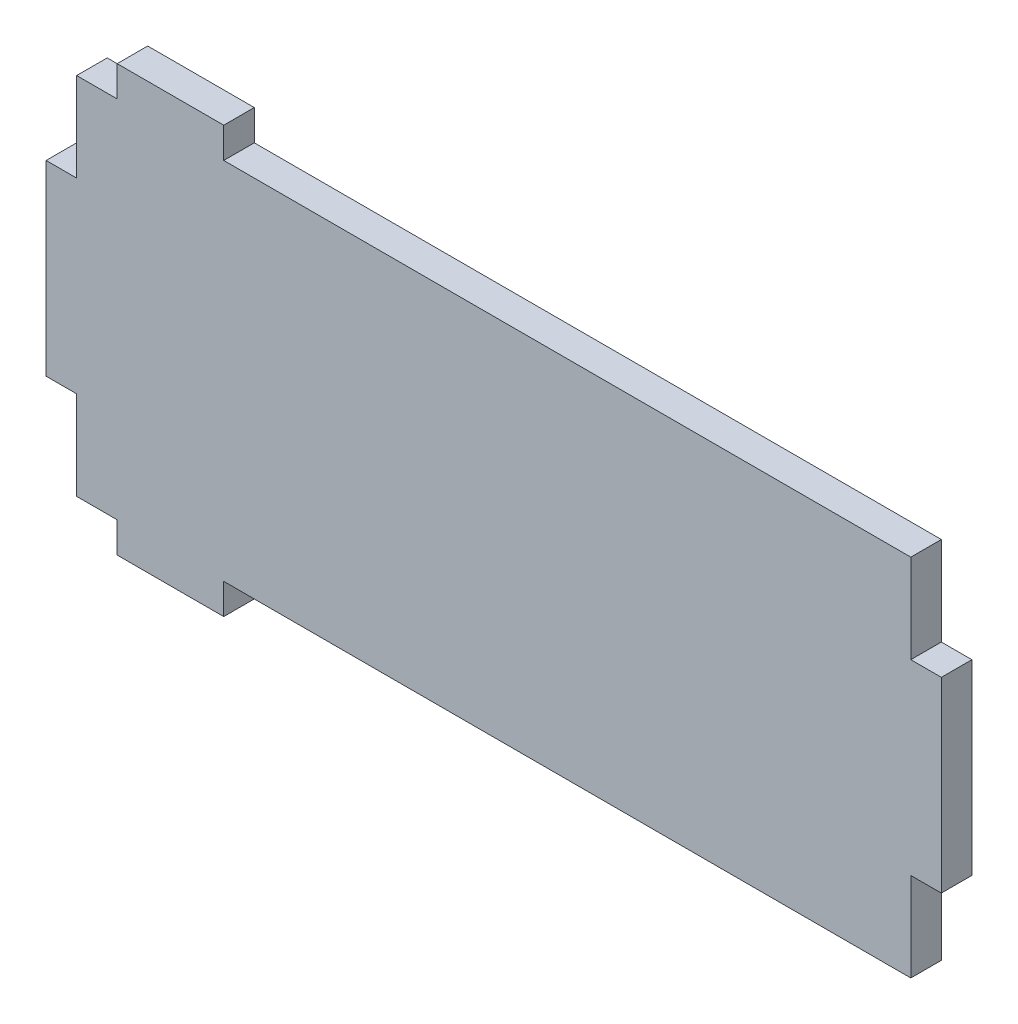
ISO-10303-21;
HEADER;
FILE_DESCRIPTION(('STEP AP214'),'2;1');
FILE_NAME('part.step','',(''),(''),'','','');
FILE_SCHEMA(('AUTOMOTIVE_DESIGN { 1 0 10303 214 1 1 1 1 }'));
ENDSEC;
DATA;
#1=APPLICATION_CONTEXT('core data for automotive mechanical design processes');
#2=APPLICATION_PROTOCOL_DEFINITION('international standard','automotive_design',2000,#1);
#3=PRODUCT_CONTEXT('',#1,'mechanical');
#4=PRODUCT('Part','Part','',(#3));
#5=PRODUCT_RELATED_PRODUCT_CATEGORY('part','',(#4));
#6=PRODUCT_DEFINITION_FORMATION('','',#4);
#7=PRODUCT_DEFINITION_CONTEXT('part definition',#1,'design');
#8=PRODUCT_DEFINITION('design','',#6,#7);
#9=PRODUCT_DEFINITION_SHAPE('','',#8);
#10=(LENGTH_UNIT() NAMED_UNIT(*) SI_UNIT(.MILLI.,.METRE.));
#11=(NAMED_UNIT(*) PLANE_ANGLE_UNIT() SI_UNIT($,.RADIAN.));
#12=(NAMED_UNIT(*) SI_UNIT($,.STERADIAN.) SOLID_ANGLE_UNIT());
#13=UNCERTAINTY_MEASURE_WITH_UNIT(LENGTH_MEASURE(1.E-05),#10,'distance_accuracy_value','');
#14=(GEOMETRIC_REPRESENTATION_CONTEXT(3) GLOBAL_UNCERTAINTY_ASSIGNED_CONTEXT((#13)) GLOBAL_UNIT_ASSIGNED_CONTEXT((#10,
#11,#12)) REPRESENTATION_CONTEXT('',''));
#15=CARTESIAN_POINT('',(0.,0.,0.));
#16=DIRECTION('',(0.,0.,1.));
#17=DIRECTION('',(1.,0.,0.));
#18=AXIS2_PLACEMENT_3D('',#15,#16,#17);
#19=CARTESIAN_POINT('',(-80.01,-32.5755,5.461));
#20=DIRECTION('',(0.,1.,0.));
#21=DIRECTION('',(0.,0.,1.));
#22=AXIS2_PLACEMENT_3D('',#19,#20,#21);
#23=PLANE('',#22);
#24=DIRECTION('',(0.,0.,1.));
#25=VECTOR('',#24,1.);
#26=CARTESIAN_POINT('',(-48.26,-32.5755,-19.8172909601691));
#27=LINE('',#26,#25);
#28=CARTESIAN_POINT('',(-48.26,-32.5755,0.));
#29=VERTEX_POINT('',#28);
#30=CARTESIAN_POINT('',(-48.26,-32.5755,5.461));
#31=VERTEX_POINT('',#30);
#32=EDGE_CURVE('E52',#29,#31,#27,.T.);
#33=ORIENTED_EDGE('',*,*,#32,.F.);
#34=DIRECTION('',(1.,0.,0.));
#35=VECTOR('',#34,1.);
#36=CARTESIAN_POINT('',(-80.01,-32.5755,0.));
#37=LINE('',#36,#35);
#38=CARTESIAN_POINT('',(74.549,-32.5755,0.));
#39=VERTEX_POINT('',#38);
#40=EDGE_CURVE('E327',#29,#39,#37,.T.);
#41=ORIENTED_EDGE('',*,*,#40,.T.);
#42=DIRECTION('',(0.,0.,1.));
#43=VECTOR('',#42,1.);
#44=CARTESIAN_POINT('',(74.549,-32.5755,0.));
#45=LINE('',#44,#43);
#46=CARTESIAN_POINT('',(74.549,-32.5755,5.461));
#47=VERTEX_POINT('',#46);
#48=EDGE_CURVE('E249',#39,#47,#45,.T.);
#49=ORIENTED_EDGE('',*,*,#48,.T.);
#50=DIRECTION('',(1.,0.,0.));
#51=VECTOR('',#50,1.);
#52=CARTESIAN_POINT('',(-80.01,-32.5755,5.461));
#53=LINE('',#52,#51);
#54=EDGE_CURVE('E44',#31,#47,#53,.T.);
#55=ORIENTED_EDGE('',*,*,#54,.F.);
#56=EDGE_LOOP('',(#33,#41,#49,#55));
#57=FACE_BOUND('',#56,.T.);
#58=ADVANCED_FACE('F35',(#57),#23,.F.);
#59=CARTESIAN_POINT('',(-80.01,32.5755,5.461));
#60=DIRECTION('',(0.,-1.,0.));
#61=DIRECTION('',(0.,0.,-1.));
#62=AXIS2_PLACEMENT_3D('',#59,#60,#61);
#63=PLANE('',#62);
#64=DIRECTION('',(0.,0.,1.));
#65=VECTOR('',#64,1.);
#66=CARTESIAN_POINT('',(-67.31,32.5755,-19.8172909601691));
#67=LINE('',#66,#65);
#68=CARTESIAN_POINT('',(-67.31,32.5755,0.));
#69=VERTEX_POINT('',#68);
#70=CARTESIAN_POINT('',(-67.31,32.5755,5.461));
#71=VERTEX_POINT('',#70);
#72=EDGE_CURVE('E229',#69,#71,#67,.T.);
#73=ORIENTED_EDGE('',*,*,#72,.F.);
#74=DIRECTION('',(-1.,0.,0.));
#75=VECTOR('',#74,1.);
#76=CARTESIAN_POINT('',(-80.01,32.5755,0.));
#77=LINE('',#76,#75);
#78=CARTESIAN_POINT('',(-74.549,32.5755,0.));
#79=VERTEX_POINT('',#78);
#80=EDGE_CURVE('E323',#69,#79,#77,.T.);
#81=ORIENTED_EDGE('',*,*,#80,.T.);
#82=DIRECTION('',(0.,0.,1.));
#83=VECTOR('',#82,1.);
#84=CARTESIAN_POINT('',(-74.549,32.5755,0.));
#85=LINE('',#84,#83);
#86=CARTESIAN_POINT('',(-74.549,32.5755,5.461));
#87=VERTEX_POINT('',#86);
#88=EDGE_CURVE('E304',#79,#87,#85,.T.);
#89=ORIENTED_EDGE('',*,*,#88,.T.);
#90=DIRECTION('',(-1.,0.,0.));
#91=VECTOR('',#90,1.);
#92=CARTESIAN_POINT('',(-80.01,32.5755,5.461));
#93=LINE('',#92,#91);
#94=EDGE_CURVE('E314',#71,#87,#93,.T.);
#95=ORIENTED_EDGE('',*,*,#94,.F.);
#96=EDGE_LOOP('',(#73,#81,#89,#95));
#97=FACE_BOUND('',#96,.T.);
#98=ADVANCED_FACE('F368',(#97),#63,.F.);
#99=CARTESIAN_POINT('',(80.01,32.5755,5.461));
#100=DIRECTION('',(-1.,0.,0.));
#101=DIRECTION('',(0.,-1.,0.));
#102=AXIS2_PLACEMENT_3D('',#99,#100,#101);
#103=PLANE('',#102);
#104=DIRECTION('',(0.,1.,0.));
#105=VECTOR('',#104,1.);
#106=CARTESIAN_POINT('',(80.01,32.5755,0.));
#107=LINE('',#106,#105);
#108=CARTESIAN_POINT('',(80.01,-16.7005,0.));
#109=VERTEX_POINT('',#108);
#110=CARTESIAN_POINT('',(80.01,16.7005,0.));
#111=VERTEX_POINT('',#110);
#112=EDGE_CURVE('E307',#109,#111,#107,.T.);
#113=ORIENTED_EDGE('',*,*,#112,.T.);
#114=DIRECTION('',(0.,0.,1.));
#115=VECTOR('',#114,1.);
#116=CARTESIAN_POINT('',(80.01,16.7005,0.));
#117=LINE('',#116,#115);
#118=CARTESIAN_POINT('',(80.01,16.7005,5.461));
#119=VERTEX_POINT('',#118);
#120=EDGE_CURVE('E267',#111,#119,#117,.T.);
#121=ORIENTED_EDGE('',*,*,#120,.T.);
#122=DIRECTION('',(0.,1.,0.));
#123=VECTOR('',#122,1.);
#124=CARTESIAN_POINT('',(80.01,32.5755,5.461));
#125=LINE('',#124,#123);
#126=CARTESIAN_POINT('',(80.01,-16.7005,5.461));
#127=VERTEX_POINT('',#126);
#128=EDGE_CURVE('E311',#127,#119,#125,.T.);
#129=ORIENTED_EDGE('',*,*,#128,.F.);
#130=DIRECTION('',(0.,0.,1.));
#131=VECTOR('',#130,1.);
#132=CARTESIAN_POINT('',(80.01,-16.7005,0.));
#133=LINE('',#132,#131);
#134=EDGE_CURVE('E244',#109,#127,#133,.T.);
#135=ORIENTED_EDGE('',*,*,#134,.F.);
#136=EDGE_LOOP('',(#113,#121,#129,#135));
#137=FACE_BOUND('',#136,.T.);
#138=ADVANCED_FACE('F37',(#137),#103,.F.);
#139=CARTESIAN_POINT('',(74.549,32.5755,0.));
#140=VERTEX_POINT('',#139);
#141=CARTESIAN_POINT('',(-48.26,32.5755,0.));
#142=VERTEX_POINT('',#141);
#143=EDGE_CURVE('E324',#140,#142,#77,.T.);
#144=ORIENTED_EDGE('',*,*,#143,.T.);
#145=DIRECTION('',(0.,0.,1.));
#146=VECTOR('',#145,1.);
#147=CARTESIAN_POINT('',(-48.26,32.5755,-19.8172909601691));
#148=LINE('',#147,#146);
#149=CARTESIAN_POINT('',(-48.26,32.5755,5.461));
#150=VERTEX_POINT('',#149);
#151=EDGE_CURVE('E233',#142,#150,#148,.T.);
#152=ORIENTED_EDGE('',*,*,#151,.T.);
#153=CARTESIAN_POINT('',(74.549,32.5755,5.461));
#154=VERTEX_POINT('',#153);
#155=EDGE_CURVE('E315',#154,#150,#93,.T.);
#156=ORIENTED_EDGE('',*,*,#155,.F.);
#157=DIRECTION('',(0.,0.,1.));
#158=VECTOR('',#157,1.);
#159=CARTESIAN_POINT('',(74.549,32.5755,0.));
#160=LINE('',#159,#158);
#161=EDGE_CURVE('E283',#140,#154,#160,.T.);
#162=ORIENTED_EDGE('',*,*,#161,.F.);
#163=EDGE_LOOP('',(#144,#152,#156,#162));
#164=FACE_BOUND('',#163,.T.);
#165=ADVANCED_FACE('F387',(#164),#63,.F.);
#166=CARTESIAN_POINT('',(-80.01,32.5755,5.461));
#167=DIRECTION('',(1.,0.,0.));
#168=DIRECTION('',(0.,1.,0.));
#169=AXIS2_PLACEMENT_3D('',#166,#167,#168);
#170=PLANE('',#169);
#171=DIRECTION('',(0.,-1.,0.));
#172=VECTOR('',#171,1.);
#173=CARTESIAN_POINT('',(-80.01,32.5755,0.));
#174=LINE('',#173,#172);
#175=CARTESIAN_POINT('',(-80.01,16.7005,0.));
#176=VERTEX_POINT('',#175);
#177=CARTESIAN_POINT('',(-80.01,-16.7005,0.));
#178=VERTEX_POINT('',#177);
#179=EDGE_CURVE('E325',#176,#178,#174,.T.);
#180=ORIENTED_EDGE('',*,*,#179,.T.);
#181=DIRECTION('',(0.,0.,1.));
#182=VECTOR('',#181,1.);
#183=CARTESIAN_POINT('',(-80.01,-16.7005,0.));
#184=LINE('',#183,#182);
#185=CARTESIAN_POINT('',(-80.01,-16.7005,5.461));
#186=VERTEX_POINT('',#185);
#187=EDGE_CURVE('E269',#178,#186,#184,.T.);
#188=ORIENTED_EDGE('',*,*,#187,.T.);
#189=DIRECTION('',(0.,-1.,0.));
#190=VECTOR('',#189,1.);
#191=CARTESIAN_POINT('',(-80.01,32.5755,5.461));
#192=LINE('',#191,#190);
#193=CARTESIAN_POINT('',(-80.01,16.7005,5.461));
#194=VERTEX_POINT('',#193);
#195=EDGE_CURVE('E318',#194,#186,#192,.T.);
#196=ORIENTED_EDGE('',*,*,#195,.F.);
#197=DIRECTION('',(0.,0.,1.));
#198=VECTOR('',#197,1.);
#199=CARTESIAN_POINT('',(-80.01,16.7005,0.));
#200=LINE('',#199,#198);
#201=EDGE_CURVE('E299',#176,#194,#200,.T.);
#202=ORIENTED_EDGE('',*,*,#201,.F.);
#203=EDGE_LOOP('',(#180,#188,#196,#202));
#204=FACE_BOUND('',#203,.T.);
#205=ADVANCED_FACE('F358',(#204),#170,.F.);
#206=CARTESIAN_POINT('',(-74.549,-32.5755,0.));
#207=VERTEX_POINT('',#206);
#208=CARTESIAN_POINT('',(-67.31,-32.5755,0.));
#209=VERTEX_POINT('',#208);
#210=EDGE_CURVE('E39',#207,#209,#37,.T.);
#211=ORIENTED_EDGE('',*,*,#210,.T.);
#212=DIRECTION('',(0.,0.,1.));
#213=VECTOR('',#212,1.);
#214=CARTESIAN_POINT('',(-67.31,-32.5755,-19.8172909601691));
#215=LINE('',#214,#213);
#216=CARTESIAN_POINT('',(-67.31,-32.5755,5.461));
#217=VERTEX_POINT('',#216);
#218=EDGE_CURVE('E204',#209,#217,#215,.T.);
#219=ORIENTED_EDGE('',*,*,#218,.T.);
#220=CARTESIAN_POINT('',(-74.549,-32.5755,5.461));
#221=VERTEX_POINT('',#220);
#222=EDGE_CURVE('E11',#221,#217,#53,.T.);
#223=ORIENTED_EDGE('',*,*,#222,.F.);
#224=DIRECTION('',(0.,0.,1.));
#225=VECTOR('',#224,1.);
#226=CARTESIAN_POINT('',(-74.549,-32.5755,0.));
#227=LINE('',#226,#225);
#228=EDGE_CURVE('E263',#207,#221,#227,.T.);
#229=ORIENTED_EDGE('',*,*,#228,.F.);
#230=EDGE_LOOP('',(#211,#219,#223,#229));
#231=FACE_BOUND('',#230,.T.);
#232=ADVANCED_FACE('F350',(#231),#23,.F.);
#233=CARTESIAN_POINT('',(0.,0.,5.461));
#234=DIRECTION('',(0.,0.,1.));
#235=DIRECTION('',(1.,0.,0.));
#236=AXIS2_PLACEMENT_3D('',#233,#234,#235);
#237=PLANE('',#236);
#238=DIRECTION('',(-1.,0.,0.));
#239=VECTOR('',#238,1.);
#240=CARTESIAN_POINT('',(-80.01,-16.7005,5.461));
#241=LINE('',#240,#239);
#242=CARTESIAN_POINT('',(-74.549,-16.7005,5.461));
#243=VERTEX_POINT('',#242);
#244=EDGE_CURVE('E260',#243,#186,#241,.T.);
#245=ORIENTED_EDGE('',*,*,#244,.F.);
#246=DIRECTION('',(0.,1.,0.));
#247=VECTOR('',#246,1.);
#248=CARTESIAN_POINT('',(-74.549,-32.5755,5.461));
#249=LINE('',#248,#247);
#250=EDGE_CURVE('E264',#221,#243,#249,.T.);
#251=ORIENTED_EDGE('',*,*,#250,.F.);
#252=ORIENTED_EDGE('',*,*,#222,.T.);
#253=DIRECTION('',(0.,-1.,0.));
#254=VECTOR('',#253,1.);
#255=CARTESIAN_POINT('',(-67.31,-32.5755,5.461));
#256=LINE('',#255,#254);
#257=CARTESIAN_POINT('',(-67.31,-38.0365,5.461));
#258=VERTEX_POINT('',#257);
#259=EDGE_CURVE('E180',#217,#258,#256,.T.);
#260=ORIENTED_EDGE('',*,*,#259,.T.);
#261=DIRECTION('',(1.,0.,0.));
#262=VECTOR('',#261,1.);
#263=CARTESIAN_POINT('',(-67.31,-38.0365,5.461));
#264=LINE('',#263,#262);
#265=CARTESIAN_POINT('',(-48.26,-38.0365,5.461));
#266=VERTEX_POINT('',#265);
#267=EDGE_CURVE('E188',#258,#266,#264,.T.);
#268=ORIENTED_EDGE('',*,*,#267,.T.);
#269=DIRECTION('',(0.,1.,0.));
#270=VECTOR('',#269,1.);
#271=CARTESIAN_POINT('',(-48.26,-32.5755,5.461));
#272=LINE('',#271,#270);
#273=EDGE_CURVE('E185',#266,#31,#272,.T.);
#274=ORIENTED_EDGE('',*,*,#273,.T.);
#275=ORIENTED_EDGE('',*,*,#54,.T.);
#276=DIRECTION('',(0.,-1.,0.));
#277=VECTOR('',#276,1.);
#278=CARTESIAN_POINT('',(74.549,-32.5755,5.461));
#279=LINE('',#278,#277);
#280=CARTESIAN_POINT('',(74.549,-16.7005,5.461));
#281=VERTEX_POINT('',#280);
#282=EDGE_CURVE('E241',#281,#47,#279,.T.);
#283=ORIENTED_EDGE('',*,*,#282,.F.);
#284=DIRECTION('',(-1.,0.,0.));
#285=VECTOR('',#284,1.);
#286=CARTESIAN_POINT('',(80.01,-16.7005,5.461));
#287=LINE('',#286,#285);
#288=EDGE_CURVE('E220',#127,#281,#287,.T.);
#289=ORIENTED_EDGE('',*,*,#288,.F.);
#290=ORIENTED_EDGE('',*,*,#128,.T.);
#291=DIRECTION('',(1.,0.,0.));
#292=VECTOR('',#291,1.);
#293=CARTESIAN_POINT('',(80.01,16.7005,5.461));
#294=LINE('',#293,#292);
#295=CARTESIAN_POINT('',(74.549,16.7005,5.461));
#296=VERTEX_POINT('',#295);
#297=EDGE_CURVE('E280',#296,#119,#294,.T.);
#298=ORIENTED_EDGE('',*,*,#297,.F.);
#299=DIRECTION('',(0.,-1.,0.));
#300=VECTOR('',#299,1.);
#301=CARTESIAN_POINT('',(74.549,32.5755,5.461));
#302=LINE('',#301,#300);
#303=EDGE_CURVE('E252',#154,#296,#302,.T.);
#304=ORIENTED_EDGE('',*,*,#303,.F.);
#305=ORIENTED_EDGE('',*,*,#155,.T.);
#306=DIRECTION('',(0.,1.,0.));
#307=VECTOR('',#306,1.);
#308=CARTESIAN_POINT('',(-48.26,32.5755,5.461));
#309=LINE('',#308,#307);
#310=CARTESIAN_POINT('',(-48.26,38.0365,5.461));
#311=VERTEX_POINT('',#310);
#312=EDGE_CURVE('E223',#150,#311,#309,.T.);
#313=ORIENTED_EDGE('',*,*,#312,.T.);
#314=DIRECTION('',(-1.,0.,0.));
#315=VECTOR('',#314,1.);
#316=CARTESIAN_POINT('',(-67.31,38.0365,5.461));
#317=LINE('',#316,#315);
#318=CARTESIAN_POINT('',(-67.31,38.0365,5.461));
#319=VERTEX_POINT('',#318);
#320=EDGE_CURVE('E226',#311,#319,#317,.T.);
#321=ORIENTED_EDGE('',*,*,#320,.T.);
#322=DIRECTION('',(0.,-1.,0.));
#323=VECTOR('',#322,1.);
#324=CARTESIAN_POINT('',(-67.31,32.5755,5.461));
#325=LINE('',#324,#323);
#326=EDGE_CURVE('E211',#319,#71,#325,.T.);
#327=ORIENTED_EDGE('',*,*,#326,.T.);
#328=ORIENTED_EDGE('',*,*,#94,.T.);
#329=DIRECTION('',(0.,1.,0.));
#330=VECTOR('',#329,1.);
#331=CARTESIAN_POINT('',(-74.549,32.5755,5.461));
#332=LINE('',#331,#330);
#333=CARTESIAN_POINT('',(-74.549,16.7005,5.461));
#334=VERTEX_POINT('',#333);
#335=EDGE_CURVE('E296',#334,#87,#332,.T.);
#336=ORIENTED_EDGE('',*,*,#335,.F.);
#337=DIRECTION('',(1.,0.,0.));
#338=VECTOR('',#337,1.);
#339=CARTESIAN_POINT('',(-80.01,16.7005,5.461));
#340=LINE('',#339,#338);
#341=EDGE_CURVE('E272',#194,#334,#340,.T.);
#342=ORIENTED_EDGE('',*,*,#341,.F.);
#343=ORIENTED_EDGE('',*,*,#195,.T.);
#344=EDGE_LOOP('',(#245,#251,#252,#260,#268,#274,#275,#283,#289,#290,#298,#304,#305,#313,#321,
#327,#328,#336,#342,#343));
#345=FACE_BOUND('',#344,.T.);
#346=ADVANCED_FACE('F196',(#345),#237,.T.);
#347=CARTESIAN_POINT('',(0.,0.,0.));
#348=DIRECTION('',(0.,0.,1.));
#349=DIRECTION('',(1.,0.,0.));
#350=AXIS2_PLACEMENT_3D('',#347,#348,#349);
#351=PLANE('',#350);
#352=DIRECTION('',(0.,1.,0.));
#353=VECTOR('',#352,1.);
#354=CARTESIAN_POINT('',(-74.549,-32.5755,0.));
#355=LINE('',#354,#353);
#356=CARTESIAN_POINT('',(-74.549,-16.7005,0.));
#357=VERTEX_POINT('',#356);
#358=EDGE_CURVE('E256',#207,#357,#355,.T.);
#359=ORIENTED_EDGE('',*,*,#358,.T.);
#360=DIRECTION('',(-1.,0.,0.));
#361=VECTOR('',#360,1.);
#362=CARTESIAN_POINT('',(-80.01,-16.7005,0.));
#363=LINE('',#362,#361);
#364=EDGE_CURVE('E259',#357,#178,#363,.T.);
#365=ORIENTED_EDGE('',*,*,#364,.T.);
#366=ORIENTED_EDGE('',*,*,#179,.F.);
#367=DIRECTION('',(1.,0.,0.));
#368=VECTOR('',#367,1.);
#369=CARTESIAN_POINT('',(-80.01,16.7005,0.));
#370=LINE('',#369,#368);
#371=CARTESIAN_POINT('',(-74.549,16.7005,0.));
#372=VERTEX_POINT('',#371);
#373=EDGE_CURVE('E292',#176,#372,#370,.T.);
#374=ORIENTED_EDGE('',*,*,#373,.T.);
#375=DIRECTION('',(0.,1.,0.));
#376=VECTOR('',#375,1.);
#377=CARTESIAN_POINT('',(-74.549,32.5755,0.));
#378=LINE('',#377,#376);
#379=EDGE_CURVE('E295',#372,#79,#378,.T.);
#380=ORIENTED_EDGE('',*,*,#379,.T.);
#381=ORIENTED_EDGE('',*,*,#80,.F.);
#382=DIRECTION('',(0.,1.,0.));
#383=VECTOR('',#382,1.);
#384=CARTESIAN_POINT('',(-67.31,32.5755,0.));
#385=LINE('',#384,#383);
#386=CARTESIAN_POINT('',(-67.31,38.0365,0.));
#387=VERTEX_POINT('',#386);
#388=EDGE_CURVE('E218',#69,#387,#385,.T.);
#389=ORIENTED_EDGE('',*,*,#388,.T.);
#390=DIRECTION('',(1.,0.,0.));
#391=VECTOR('',#390,1.);
#392=CARTESIAN_POINT('',(-67.31,38.0365,0.));
#393=LINE('',#392,#391);
#394=CARTESIAN_POINT('',(-48.26,38.0365,0.));
#395=VERTEX_POINT('',#394);
#396=EDGE_CURVE('E215',#387,#395,#393,.T.);
#397=ORIENTED_EDGE('',*,*,#396,.T.);
#398=DIRECTION('',(0.,-1.,0.));
#399=VECTOR('',#398,1.);
#400=CARTESIAN_POINT('',(-48.26,32.5755,0.));
#401=LINE('',#400,#399);
#402=EDGE_CURVE('E212',#395,#142,#401,.T.);
#403=ORIENTED_EDGE('',*,*,#402,.T.);
#404=ORIENTED_EDGE('',*,*,#143,.F.);
#405=DIRECTION('',(0.,-1.,0.));
#406=VECTOR('',#405,1.);
#407=CARTESIAN_POINT('',(74.549,32.5755,0.));
#408=LINE('',#407,#406);
#409=CARTESIAN_POINT('',(74.549,16.7005,0.));
#410=VERTEX_POINT('',#409);
#411=EDGE_CURVE('E276',#140,#410,#408,.T.);
#412=ORIENTED_EDGE('',*,*,#411,.T.);
#413=DIRECTION('',(1.,0.,0.));
#414=VECTOR('',#413,1.);
#415=CARTESIAN_POINT('',(80.01,16.7005,0.));
#416=LINE('',#415,#414);
#417=EDGE_CURVE('E279',#410,#111,#416,.T.);
#418=ORIENTED_EDGE('',*,*,#417,.T.);
#419=ORIENTED_EDGE('',*,*,#112,.F.);
#420=DIRECTION('',(-1.,0.,0.));
#421=VECTOR('',#420,1.);
#422=CARTESIAN_POINT('',(80.01,-16.7005,0.));
#423=LINE('',#422,#421);
#424=CARTESIAN_POINT('',(74.549,-16.7005,0.));
#425=VERTEX_POINT('',#424);
#426=EDGE_CURVE('E237',#109,#425,#423,.T.);
#427=ORIENTED_EDGE('',*,*,#426,.T.);
#428=DIRECTION('',(0.,-1.,0.));
#429=VECTOR('',#428,1.);
#430=CARTESIAN_POINT('',(74.549,-32.5755,0.));
#431=LINE('',#430,#429);
#432=EDGE_CURVE('E240',#425,#39,#431,.T.);
#433=ORIENTED_EDGE('',*,*,#432,.T.);
#434=ORIENTED_EDGE('',*,*,#40,.F.);
#435=DIRECTION('',(0.,-1.,0.));
#436=VECTOR('',#435,1.);
#437=CARTESIAN_POINT('',(-48.26,-32.5755,0.));
#438=LINE('',#437,#436);
#439=CARTESIAN_POINT('',(-48.26,-38.0365,0.));
#440=VERTEX_POINT('',#439);
#441=EDGE_CURVE('E206',#29,#440,#438,.T.);
#442=ORIENTED_EDGE('',*,*,#441,.T.);
#443=DIRECTION('',(-1.,0.,0.));
#444=VECTOR('',#443,1.);
#445=CARTESIAN_POINT('',(-67.31,-38.0365,0.));
#446=LINE('',#445,#444);
#447=CARTESIAN_POINT('',(-67.31,-38.0365,0.));
#448=VERTEX_POINT('',#447);
#449=EDGE_CURVE('E209',#440,#448,#446,.T.);
#450=ORIENTED_EDGE('',*,*,#449,.T.);
#451=DIRECTION('',(0.,1.,0.));
#452=VECTOR('',#451,1.);
#453=CARTESIAN_POINT('',(-67.31,-32.5755,0.));
#454=LINE('',#453,#452);
#455=EDGE_CURVE('E181',#448,#209,#454,.T.);
#456=ORIENTED_EDGE('',*,*,#455,.T.);
#457=ORIENTED_EDGE('',*,*,#210,.F.);
#458=EDGE_LOOP('',(#359,#365,#366,#374,#380,#381,#389,#397,#403,#404,#412,#418,#419,#427,#433,
#434,#442,#450,#456,#457));
#459=FACE_BOUND('',#458,.T.);
#460=ADVANCED_FACE('F338',(#459),#351,.F.);
#461=CARTESIAN_POINT('',(-74.549,32.5755,0.));
#462=DIRECTION('',(1.,0.,0.));
#463=DIRECTION('',(0.,0.,-1.));
#464=AXIS2_PLACEMENT_3D('',#461,#462,#463);
#465=PLANE('',#464);
#466=ORIENTED_EDGE('',*,*,#335,.T.);
#467=ORIENTED_EDGE('',*,*,#88,.F.);
#468=ORIENTED_EDGE('',*,*,#379,.F.);
#469=DIRECTION('',(0.,0.,1.));
#470=VECTOR('',#469,1.);
#471=CARTESIAN_POINT('',(-74.549,16.7005,0.));
#472=LINE('',#471,#470);
#473=EDGE_CURVE('E308',#372,#334,#472,.T.);
#474=ORIENTED_EDGE('',*,*,#473,.T.);
#475=EDGE_LOOP('',(#466,#467,#468,#474));
#476=FACE_BOUND('',#475,.T.);
#477=ADVANCED_FACE('F365',(#476),#465,.F.);
#478=CARTESIAN_POINT('',(-80.01,16.7005,0.));
#479=DIRECTION('',(0.,-1.,0.));
#480=DIRECTION('',(0.,0.,-1.));
#481=AXIS2_PLACEMENT_3D('',#478,#479,#480);
#482=PLANE('',#481);
#483=ORIENTED_EDGE('',*,*,#341,.T.);
#484=ORIENTED_EDGE('',*,*,#473,.F.);
#485=ORIENTED_EDGE('',*,*,#373,.F.);
#486=ORIENTED_EDGE('',*,*,#201,.T.);
#487=EDGE_LOOP('',(#483,#484,#485,#486));
#488=FACE_BOUND('',#487,.T.);
#489=ADVANCED_FACE('F362',(#488),#482,.F.);
#490=CARTESIAN_POINT('',(74.549,-32.5755,0.));
#491=DIRECTION('',(-1.,0.,0.));
#492=DIRECTION('',(0.,0.,1.));
#493=AXIS2_PLACEMENT_3D('',#490,#491,#492);
#494=PLANE('',#493);
#495=ORIENTED_EDGE('',*,*,#282,.T.);
#496=ORIENTED_EDGE('',*,*,#48,.F.);
#497=ORIENTED_EDGE('',*,*,#432,.F.);
#498=DIRECTION('',(0.,0.,1.));
#499=VECTOR('',#498,1.);
#500=CARTESIAN_POINT('',(74.549,-16.7005,0.));
#501=LINE('',#500,#499);
#502=EDGE_CURVE('E253',#425,#281,#501,.T.);
#503=ORIENTED_EDGE('',*,*,#502,.T.);
#504=EDGE_LOOP('',(#495,#496,#497,#503));
#505=FACE_BOUND('',#504,.T.);
#506=ADVANCED_FACE('F335',(#505),#494,.F.);
#507=CARTESIAN_POINT('',(80.01,-16.7005,0.));
#508=DIRECTION('',(0.,1.,0.));
#509=DIRECTION('',(0.,0.,1.));
#510=AXIS2_PLACEMENT_3D('',#507,#508,#509);
#511=PLANE('',#510);
#512=ORIENTED_EDGE('',*,*,#288,.T.);
#513=ORIENTED_EDGE('',*,*,#502,.F.);
#514=ORIENTED_EDGE('',*,*,#426,.F.);
#515=ORIENTED_EDGE('',*,*,#134,.T.);
#516=EDGE_LOOP('',(#512,#513,#514,#515));
#517=FACE_BOUND('',#516,.T.);
#518=ADVANCED_FACE('F342',(#517),#511,.F.);
#519=CARTESIAN_POINT('',(80.01,16.7005,0.));
#520=DIRECTION('',(0.,-1.,0.));
#521=DIRECTION('',(1.,0.,0.));
#522=AXIS2_PLACEMENT_3D('',#519,#520,#521);
#523=PLANE('',#522);
#524=ORIENTED_EDGE('',*,*,#297,.T.);
#525=ORIENTED_EDGE('',*,*,#120,.F.);
#526=ORIENTED_EDGE('',*,*,#417,.F.);
#527=DIRECTION('',(0.,0.,1.));
#528=VECTOR('',#527,1.);
#529=CARTESIAN_POINT('',(74.549,16.7005,0.));
#530=LINE('',#529,#528);
#531=EDGE_CURVE('E289',#410,#296,#530,.T.);
#532=ORIENTED_EDGE('',*,*,#531,.T.);
#533=EDGE_LOOP('',(#524,#525,#526,#532));
#534=FACE_BOUND('',#533,.T.);
#535=ADVANCED_FACE('F393',(#534),#523,.F.);
#536=CARTESIAN_POINT('',(74.549,32.5755,0.));
#537=DIRECTION('',(-1.,0.,0.));
#538=DIRECTION('',(0.,0.,1.));
#539=AXIS2_PLACEMENT_3D('',#536,#537,#538);
#540=PLANE('',#539);
#541=ORIENTED_EDGE('',*,*,#303,.T.);
#542=ORIENTED_EDGE('',*,*,#531,.F.);
#543=ORIENTED_EDGE('',*,*,#411,.F.);
#544=ORIENTED_EDGE('',*,*,#161,.T.);
#545=EDGE_LOOP('',(#541,#542,#543,#544));
#546=FACE_BOUND('',#545,.T.);
#547=ADVANCED_FACE('F391',(#546),#540,.F.);
#548=CARTESIAN_POINT('',(-80.01,-16.7005,0.));
#549=DIRECTION('',(0.,1.,0.));
#550=DIRECTION('',(0.,0.,1.));
#551=AXIS2_PLACEMENT_3D('',#548,#549,#550);
#552=PLANE('',#551);
#553=ORIENTED_EDGE('',*,*,#244,.T.);
#554=ORIENTED_EDGE('',*,*,#187,.F.);
#555=ORIENTED_EDGE('',*,*,#364,.F.);
#556=DIRECTION('',(0.,0.,1.));
#557=VECTOR('',#556,1.);
#558=CARTESIAN_POINT('',(-74.549,-16.7005,0.));
#559=LINE('',#558,#557);
#560=EDGE_CURVE('E273',#357,#243,#559,.T.);
#561=ORIENTED_EDGE('',*,*,#560,.T.);
#562=EDGE_LOOP('',(#553,#554,#555,#561));
#563=FACE_BOUND('',#562,.T.);
#564=ADVANCED_FACE('F357',(#563),#552,.F.);
#565=CARTESIAN_POINT('',(-74.549,-32.5755,0.));
#566=DIRECTION('',(1.,0.,0.));
#567=DIRECTION('',(0.,0.,-1.));
#568=AXIS2_PLACEMENT_3D('',#565,#566,#567);
#569=PLANE('',#568);
#570=ORIENTED_EDGE('',*,*,#250,.T.);
#571=ORIENTED_EDGE('',*,*,#560,.F.);
#572=ORIENTED_EDGE('',*,*,#358,.F.);
#573=ORIENTED_EDGE('',*,*,#228,.T.);
#574=EDGE_LOOP('',(#570,#571,#572,#573));
#575=FACE_BOUND('',#574,.T.);
#576=ADVANCED_FACE('F352',(#575),#569,.F.);
#577=CARTESIAN_POINT('',(-67.31,32.5755,-19.8172909601691));
#578=DIRECTION('',(-1.,0.,0.));
#579=DIRECTION('',(0.,0.,1.));
#580=AXIS2_PLACEMENT_3D('',#577,#578,#579);
#581=PLANE('',#580);
#582=ORIENTED_EDGE('',*,*,#388,.F.);
#583=ORIENTED_EDGE('',*,*,#72,.T.);
#584=ORIENTED_EDGE('',*,*,#326,.F.);
#585=DIRECTION('',(0.,0.,1.));
#586=VECTOR('',#585,1.);
#587=CARTESIAN_POINT('',(-67.31,38.0365,-19.8172909601691));
#588=LINE('',#587,#586);
#589=EDGE_CURVE('E216',#387,#319,#588,.T.);
#590=ORIENTED_EDGE('',*,*,#589,.F.);
#591=EDGE_LOOP('',(#582,#583,#584,#590));
#592=FACE_BOUND('',#591,.T.);
#593=ADVANCED_FACE('F373',(#592),#581,.T.);
#594=CARTESIAN_POINT('',(-67.31,38.0365,-19.8172909601691));
#595=DIRECTION('',(0.,1.,0.));
#596=DIRECTION('',(0.,0.,1.));
#597=AXIS2_PLACEMENT_3D('',#594,#595,#596);
#598=PLANE('',#597);
#599=ORIENTED_EDGE('',*,*,#396,.F.);
#600=ORIENTED_EDGE('',*,*,#589,.T.);
#601=ORIENTED_EDGE('',*,*,#320,.F.);
#602=DIRECTION('',(0.,0.,1.));
#603=VECTOR('',#602,1.);
#604=CARTESIAN_POINT('',(-48.26,38.0365,-19.8172909601691));
#605=LINE('',#604,#603);
#606=EDGE_CURVE('E231',#395,#311,#605,.T.);
#607=ORIENTED_EDGE('',*,*,#606,.F.);
#608=EDGE_LOOP('',(#599,#600,#601,#607));
#609=FACE_BOUND('',#608,.T.);
#610=ADVANCED_FACE('F377',(#609),#598,.T.);
#611=CARTESIAN_POINT('',(-48.26,32.5755,-19.8172909601691));
#612=DIRECTION('',(1.,0.,0.));
#613=DIRECTION('',(0.,0.,-1.));
#614=AXIS2_PLACEMENT_3D('',#611,#612,#613);
#615=PLANE('',#614);
#616=ORIENTED_EDGE('',*,*,#402,.F.);
#617=ORIENTED_EDGE('',*,*,#606,.T.);
#618=ORIENTED_EDGE('',*,*,#312,.F.);
#619=ORIENTED_EDGE('',*,*,#151,.F.);
#620=EDGE_LOOP('',(#616,#617,#618,#619));
#621=FACE_BOUND('',#620,.T.);
#622=ADVANCED_FACE('F383',(#621),#615,.T.);
#623=CARTESIAN_POINT('',(-67.31,-32.5755,-19.8172909601691));
#624=DIRECTION('',(-1.,0.,0.));
#625=DIRECTION('',(0.,0.,1.));
#626=AXIS2_PLACEMENT_3D('',#623,#624,#625);
#627=PLANE('',#626);
#628=ORIENTED_EDGE('',*,*,#455,.F.);
#629=DIRECTION('',(0.,0.,1.));
#630=VECTOR('',#629,1.);
#631=CARTESIAN_POINT('',(-67.31,-38.0365,-19.8172909601691));
#632=LINE('',#631,#630);
#633=EDGE_CURVE('E175',#448,#258,#632,.T.);
#634=ORIENTED_EDGE('',*,*,#633,.T.);
#635=ORIENTED_EDGE('',*,*,#259,.F.);
#636=ORIENTED_EDGE('',*,*,#218,.F.);
#637=EDGE_LOOP('',(#628,#634,#635,#636));
#638=FACE_BOUND('',#637,.T.);
#639=ADVANCED_FACE('F177',(#638),#627,.T.);
#640=CARTESIAN_POINT('',(-48.26,-32.5755,-19.8172909601691));
#641=DIRECTION('',(1.,0.,0.));
#642=DIRECTION('',(0.,0.,-1.));
#643=AXIS2_PLACEMENT_3D('',#640,#641,#642);
#644=PLANE('',#643);
#645=ORIENTED_EDGE('',*,*,#441,.F.);
#646=ORIENTED_EDGE('',*,*,#32,.T.);
#647=ORIENTED_EDGE('',*,*,#273,.F.);
#648=DIRECTION('',(0.,0.,1.));
#649=VECTOR('',#648,1.);
#650=CARTESIAN_POINT('',(-48.26,-38.0365,-19.8172909601691));
#651=LINE('',#650,#649);
#652=EDGE_CURVE('E184',#440,#266,#651,.T.);
#653=ORIENTED_EDGE('',*,*,#652,.F.);
#654=EDGE_LOOP('',(#645,#646,#647,#653));
#655=FACE_BOUND('',#654,.T.);
#656=ADVANCED_FACE('F349',(#655),#644,.T.);
#657=CARTESIAN_POINT('',(-67.31,-38.0365,-19.8172909601691));
#658=DIRECTION('',(0.,-1.,0.));
#659=DIRECTION('',(0.,0.,-1.));
#660=AXIS2_PLACEMENT_3D('',#657,#658,#659);
#661=PLANE('',#660);
#662=ORIENTED_EDGE('',*,*,#449,.F.);
#663=ORIENTED_EDGE('',*,*,#652,.T.);
#664=ORIENTED_EDGE('',*,*,#267,.F.);
#665=ORIENTED_EDGE('',*,*,#633,.F.);
#666=EDGE_LOOP('',(#662,#663,#664,#665));
#667=FACE_BOUND('',#666,.T.);
#668=ADVANCED_FACE('F189',(#667),#661,.T.);
#669=CLOSED_SHELL('',(#58,#98,#138,#165,#205,#232,#346,#460,#477,#489,#506,#518,#535,#547,#564,
#576,#593,#610,#622,#639,#656,#668));
#670=MANIFOLD_SOLID_BREP('B2',#669);
#671=ADVANCED_BREP_SHAPE_REPRESENTATION('',(#18,#670),#14);
#672=SHAPE_DEFINITION_REPRESENTATION(#9,#671);
ENDSEC;
END-ISO-10303-21;
